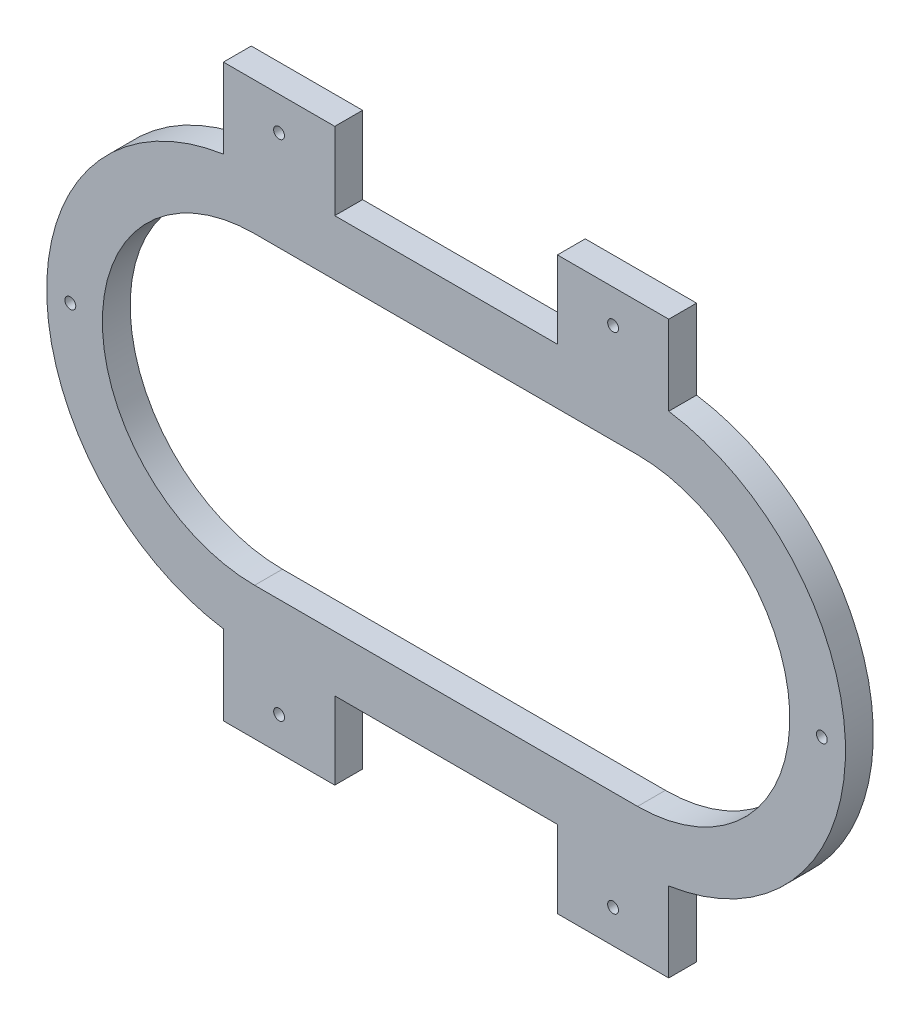
ISO-10303-21;
HEADER;
FILE_DESCRIPTION(('STEP AP214'),'2;1');
FILE_NAME('part.step','',(''),(''),'','','');
FILE_SCHEMA(('AUTOMOTIVE_DESIGN { 1 0 10303 214 1 1 1 1 }'));
ENDSEC;
DATA;
#1=APPLICATION_CONTEXT('core data for automotive mechanical design processes');
#2=APPLICATION_PROTOCOL_DEFINITION('international standard','automotive_design',2000,#1);
#3=PRODUCT_CONTEXT('',#1,'mechanical');
#4=PRODUCT('Part','Part','',(#3));
#5=PRODUCT_RELATED_PRODUCT_CATEGORY('part','',(#4));
#6=PRODUCT_DEFINITION_FORMATION('','',#4);
#7=PRODUCT_DEFINITION_CONTEXT('part definition',#1,'design');
#8=PRODUCT_DEFINITION('design','',#6,#7);
#9=PRODUCT_DEFINITION_SHAPE('','',#8);
#10=(LENGTH_UNIT() NAMED_UNIT(*) SI_UNIT(.MILLI.,.METRE.));
#11=(NAMED_UNIT(*) PLANE_ANGLE_UNIT() SI_UNIT($,.RADIAN.));
#12=(NAMED_UNIT(*) SI_UNIT($,.STERADIAN.) SOLID_ANGLE_UNIT());
#13=UNCERTAINTY_MEASURE_WITH_UNIT(LENGTH_MEASURE(1.E-05),#10,'distance_accuracy_value','');
#14=(GEOMETRIC_REPRESENTATION_CONTEXT(3) GLOBAL_UNCERTAINTY_ASSIGNED_CONTEXT((#13)) GLOBAL_UNIT_ASSIGNED_CONTEXT((#10,
#11,#12)) REPRESENTATION_CONTEXT('',''));
#15=CARTESIAN_POINT('',(0.,0.,0.));
#16=DIRECTION('',(0.,0.,1.));
#17=DIRECTION('',(1.,0.,0.));
#18=AXIS2_PLACEMENT_3D('',#15,#16,#17);
#19=CARTESIAN_POINT('',(67.4451075179196,6.36799466577763,10.));
#20=DIRECTION('',(0.,0.,-1.));
#21=DIRECTION('',(-1.,0.,0.));
#22=AXIS2_PLACEMENT_3D('',#19,#20,#21);
#23=CYLINDRICAL_SURFACE('',#22,54.7);
#24=CARTESIAN_POINT('',(67.4451075179196,6.36799466577763,0.));
#25=DIRECTION('',(0.,0.,1.));
#26=DIRECTION('',(1.,0.,0.));
#27=AXIS2_PLACEMENT_3D('',#24,#25,#26);
#28=CIRCLE('',#27,54.7);
#29=CARTESIAN_POINT('',(67.4451075179196,-48.3320053342224,0.));
#30=VERTEX_POINT('',#29);
#31=CARTESIAN_POINT('',(67.4451075179196,61.0679946657776,0.));
#32=VERTEX_POINT('',#31);
#33=EDGE_CURVE('E264',#30,#32,#28,.T.);
#34=ORIENTED_EDGE('',*,*,#33,.F.);
#35=DIRECTION('',(0.,0.,-1.));
#36=VECTOR('',#35,1.);
#37=CARTESIAN_POINT('',(67.4451075179196,-48.3320053342224,10.));
#38=LINE('',#37,#36);
#39=CARTESIAN_POINT('',(67.4451075179196,-48.3320053342224,10.));
#40=VERTEX_POINT('',#39);
#41=EDGE_CURVE('E11',#40,#30,#38,.T.);
#42=ORIENTED_EDGE('',*,*,#41,.F.);
#43=CARTESIAN_POINT('',(67.4451075179196,6.36799466577763,10.));
#44=DIRECTION('',(0.,0.,1.));
#45=DIRECTION('',(1.,0.,0.));
#46=AXIS2_PLACEMENT_3D('',#43,#44,#45);
#47=CIRCLE('',#46,54.7);
#48=CARTESIAN_POINT('',(67.4451075179196,61.0679946657776,10.));
#49=VERTEX_POINT('',#48);
#50=EDGE_CURVE('E198',#40,#49,#47,.T.);
#51=ORIENTED_EDGE('',*,*,#50,.T.);
#52=DIRECTION('',(0.,0.,-1.));
#53=VECTOR('',#52,1.);
#54=CARTESIAN_POINT('',(67.4451075179196,61.0679946657776,10.));
#55=LINE('',#54,#53);
#56=EDGE_CURVE('E126',#49,#32,#55,.T.);
#57=ORIENTED_EDGE('',*,*,#56,.T.);
#58=EDGE_LOOP('',(#34,#42,#51,#57));
#59=FACE_BOUND('',#58,.T.);
#60=ADVANCED_FACE('F37',(#59),#23,.F.);
#61=CARTESIAN_POINT('',(0.,-48.3320053342224,10.));
#62=DIRECTION('',(0.,1.,0.));
#63=DIRECTION('',(0.,0.,1.));
#64=AXIS2_PLACEMENT_3D('',#61,#62,#63);
#65=PLANE('',#64);
#66=DIRECTION('',(1.,0.,0.));
#67=VECTOR('',#66,1.);
#68=CARTESIAN_POINT('',(0.,-48.3320053342224,0.));
#69=LINE('',#68,#67);
#70=CARTESIAN_POINT('',(-70.1548924820804,-48.3320053342224,0.));
#71=VERTEX_POINT('',#70);
#72=EDGE_CURVE('E189',#71,#30,#69,.T.);
#73=ORIENTED_EDGE('',*,*,#72,.F.);
#74=DIRECTION('',(0.,0.,-1.));
#75=VECTOR('',#74,1.);
#76=CARTESIAN_POINT('',(-70.1548924820804,-48.3320053342224,10.));
#77=LINE('',#76,#75);
#78=CARTESIAN_POINT('',(-70.1548924820804,-48.3320053342224,10.));
#79=VERTEX_POINT('',#78);
#80=EDGE_CURVE('E47',#79,#71,#77,.T.);
#81=ORIENTED_EDGE('',*,*,#80,.F.);
#82=DIRECTION('',(1.,0.,0.));
#83=VECTOR('',#82,1.);
#84=CARTESIAN_POINT('',(0.,-48.3320053342224,10.));
#85=LINE('',#84,#83);
#86=EDGE_CURVE('E187',#79,#40,#85,.T.);
#87=ORIENTED_EDGE('',*,*,#86,.T.);
#88=ORIENTED_EDGE('',*,*,#41,.T.);
#89=EDGE_LOOP('',(#73,#81,#87,#88));
#90=FACE_BOUND('',#89,.T.);
#91=ADVANCED_FACE('F186',(#90),#65,.T.);
#92=CARTESIAN_POINT('',(-70.1548924820804,6.36799466577763,10.));
#93=DIRECTION('',(0.,0.,-1.));
#94=DIRECTION('',(-1.,0.,0.));
#95=AXIS2_PLACEMENT_3D('',#92,#93,#94);
#96=CYLINDRICAL_SURFACE('',#95,54.7);
#97=CARTESIAN_POINT('',(-70.1548924820804,6.36799466577763,0.));
#98=DIRECTION('',(0.,0.,1.));
#99=DIRECTION('',(1.,0.,0.));
#100=AXIS2_PLACEMENT_3D('',#97,#98,#99);
#101=CIRCLE('',#100,54.7);
#102=CARTESIAN_POINT('',(-70.1548924820804,61.0679946657776,0.));
#103=VERTEX_POINT('',#102);
#104=EDGE_CURVE('E268',#103,#71,#101,.T.);
#105=ORIENTED_EDGE('',*,*,#104,.F.);
#106=DIRECTION('',(0.,0.,-1.));
#107=VECTOR('',#106,1.);
#108=CARTESIAN_POINT('',(-70.1548924820804,61.0679946657776,10.));
#109=LINE('',#108,#107);
#110=CARTESIAN_POINT('',(-70.1548924820804,61.0679946657776,10.));
#111=VERTEX_POINT('',#110);
#112=EDGE_CURVE('E119',#111,#103,#109,.T.);
#113=ORIENTED_EDGE('',*,*,#112,.F.);
#114=CARTESIAN_POINT('',(-70.1548924820804,6.36799466577763,10.));
#115=DIRECTION('',(0.,0.,1.));
#116=DIRECTION('',(1.,0.,0.));
#117=AXIS2_PLACEMENT_3D('',#114,#115,#116);
#118=CIRCLE('',#117,54.7);
#119=EDGE_CURVE('E197',#111,#79,#118,.T.);
#120=ORIENTED_EDGE('',*,*,#119,.T.);
#121=ORIENTED_EDGE('',*,*,#80,.T.);
#122=EDGE_LOOP('',(#105,#113,#120,#121));
#123=FACE_BOUND('',#122,.T.);
#124=ADVANCED_FACE('F200',(#123),#96,.F.);
#125=CARTESIAN_POINT('',(0.,81.0679946657776,10.));
#126=DIRECTION('',(0.,1.,0.));
#127=DIRECTION('',(0.,0.,1.));
#128=AXIS2_PLACEMENT_3D('',#125,#126,#127);
#129=PLANE('',#128);
#130=DIRECTION('',(1.,0.,0.));
#131=VECTOR('',#130,1.);
#132=CARTESIAN_POINT('',(0.,81.0679946657776,0.));
#133=LINE('',#132,#131);
#134=CARTESIAN_POINT('',(-41.3548924820804,81.0679946657776,0.));
#135=VERTEX_POINT('',#134);
#136=CARTESIAN_POINT('',(38.6451075179196,81.0679946657776,0.));
#137=VERTEX_POINT('',#136);
#138=EDGE_CURVE('E218',#135,#137,#133,.T.);
#139=ORIENTED_EDGE('',*,*,#138,.F.);
#140=DIRECTION('',(0.,0.,-1.));
#141=VECTOR('',#140,1.);
#142=CARTESIAN_POINT('',(-41.3548924820804,81.0679946657776,10.));
#143=LINE('',#142,#141);
#144=CARTESIAN_POINT('',(-41.3548924820804,81.0679946657776,10.));
#145=VERTEX_POINT('',#144);
#146=EDGE_CURVE('E41',#145,#135,#143,.T.);
#147=ORIENTED_EDGE('',*,*,#146,.F.);
#148=DIRECTION('',(1.,0.,0.));
#149=VECTOR('',#148,1.);
#150=CARTESIAN_POINT('',(0.,81.0679946657776,10.));
#151=LINE('',#150,#149);
#152=CARTESIAN_POINT('',(38.6451075179196,81.0679946657776,10.));
#153=VERTEX_POINT('',#152);
#154=EDGE_CURVE('E284',#145,#153,#151,.T.);
#155=ORIENTED_EDGE('',*,*,#154,.T.);
#156=DIRECTION('',(0.,0.,-1.));
#157=VECTOR('',#156,1.);
#158=CARTESIAN_POINT('',(38.6451075179196,81.0679946657776,10.));
#159=LINE('',#158,#157);
#160=EDGE_CURVE('E217',#153,#137,#159,.T.);
#161=ORIENTED_EDGE('',*,*,#160,.T.);
#162=EDGE_LOOP('',(#139,#147,#155,#161));
#163=FACE_BOUND('',#162,.T.);
#164=ADVANCED_FACE('F39',(#163),#129,.T.);
#165=CARTESIAN_POINT('',(-41.3548924820804,0.,10.));
#166=DIRECTION('',(-1.,0.,0.));
#167=DIRECTION('',(0.,0.,1.));
#168=AXIS2_PLACEMENT_3D('',#165,#166,#167);
#169=PLANE('',#168);
#170=DIRECTION('',(0.,1.,0.));
#171=VECTOR('',#170,1.);
#172=CARTESIAN_POINT('',(-41.3548924820804,0.,0.));
#173=LINE('',#172,#171);
#174=CARTESIAN_POINT('',(-41.3548924820804,108.867994665778,0.));
#175=VERTEX_POINT('',#174);
#176=EDGE_CURVE('E221',#135,#175,#173,.T.);
#177=ORIENTED_EDGE('',*,*,#176,.T.);
#178=DIRECTION('',(0.,0.,-1.));
#179=VECTOR('',#178,1.);
#180=CARTESIAN_POINT('',(-41.3548924820804,108.867994665778,10.));
#181=LINE('',#180,#179);
#182=CARTESIAN_POINT('',(-41.3548924820804,108.867994665778,10.));
#183=VERTEX_POINT('',#182);
#184=EDGE_CURVE('E320',#183,#175,#181,.T.);
#185=ORIENTED_EDGE('',*,*,#184,.F.);
#186=DIRECTION('',(0.,1.,0.));
#187=VECTOR('',#186,1.);
#188=CARTESIAN_POINT('',(-41.3548924820804,0.,10.));
#189=LINE('',#188,#187);
#190=EDGE_CURVE('E329',#145,#183,#189,.T.);
#191=ORIENTED_EDGE('',*,*,#190,.F.);
#192=ORIENTED_EDGE('',*,*,#146,.T.);
#193=EDGE_LOOP('',(#177,#185,#191,#192));
#194=FACE_BOUND('',#193,.T.);
#195=ADVANCED_FACE('F328',(#194),#169,.F.);
#196=CARTESIAN_POINT('',(0.,108.867994665778,10.));
#197=DIRECTION('',(0.,-1.,0.));
#198=DIRECTION('',(0.,0.,-1.));
#199=AXIS2_PLACEMENT_3D('',#196,#197,#198);
#200=PLANE('',#199);
#201=DIRECTION('',(-1.,0.,0.));
#202=VECTOR('',#201,1.);
#203=CARTESIAN_POINT('',(0.,108.867994665778,0.));
#204=LINE('',#203,#202);
#205=CARTESIAN_POINT('',(-81.3548924820804,108.867994665778,0.));
#206=VERTEX_POINT('',#205);
#207=EDGE_CURVE('E223',#175,#206,#204,.T.);
#208=ORIENTED_EDGE('',*,*,#207,.T.);
#209=DIRECTION('',(0.,0.,-1.));
#210=VECTOR('',#209,1.);
#211=CARTESIAN_POINT('',(-81.3548924820804,108.867994665778,10.));
#212=LINE('',#211,#210);
#213=CARTESIAN_POINT('',(-81.3548924820804,108.867994665778,10.));
#214=VERTEX_POINT('',#213);
#215=EDGE_CURVE('E318',#214,#206,#212,.T.);
#216=ORIENTED_EDGE('',*,*,#215,.F.);
#217=DIRECTION('',(-1.,0.,0.));
#218=VECTOR('',#217,1.);
#219=CARTESIAN_POINT('',(0.,108.867994665778,10.));
#220=LINE('',#219,#218);
#221=EDGE_CURVE('E410',#183,#214,#220,.T.);
#222=ORIENTED_EDGE('',*,*,#221,.F.);
#223=ORIENTED_EDGE('',*,*,#184,.T.);
#224=EDGE_LOOP('',(#208,#216,#222,#223));
#225=FACE_BOUND('',#224,.T.);
#226=ADVANCED_FACE('F409',(#225),#200,.F.);
#227=CARTESIAN_POINT('',(-81.3548924820804,0.,10.));
#228=DIRECTION('',(1.,0.,0.));
#229=DIRECTION('',(0.,0.,-1.));
#230=AXIS2_PLACEMENT_3D('',#227,#228,#229);
#231=PLANE('',#230);
#232=DIRECTION('',(0.,-1.,0.));
#233=VECTOR('',#232,1.);
#234=CARTESIAN_POINT('',(-81.3548924820804,0.,0.));
#235=LINE('',#234,#233);
#236=CARTESIAN_POINT('',(-81.3548924820804,80.223597026059,0.));
#237=VERTEX_POINT('',#236);
#238=EDGE_CURVE('E225',#206,#237,#235,.T.);
#239=ORIENTED_EDGE('',*,*,#238,.T.);
#240=DIRECTION('',(0.,0.,-1.));
#241=VECTOR('',#240,1.);
#242=CARTESIAN_POINT('',(-81.3548924820804,80.223597026059,10.));
#243=LINE('',#242,#241);
#244=CARTESIAN_POINT('',(-81.3548924820804,80.223597026059,10.));
#245=VERTEX_POINT('',#244);
#246=EDGE_CURVE('E315',#245,#237,#243,.T.);
#247=ORIENTED_EDGE('',*,*,#246,.F.);
#248=DIRECTION('',(0.,-1.,0.));
#249=VECTOR('',#248,1.);
#250=CARTESIAN_POINT('',(-81.3548924820804,0.,10.));
#251=LINE('',#250,#249);
#252=EDGE_CURVE('E407',#214,#245,#251,.T.);
#253=ORIENTED_EDGE('',*,*,#252,.F.);
#254=ORIENTED_EDGE('',*,*,#215,.T.);
#255=EDGE_LOOP('',(#239,#247,#253,#254));
#256=FACE_BOUND('',#255,.T.);
#257=ADVANCED_FACE('F406',(#256),#231,.F.);
#258=CARTESIAN_POINT('',(-70.1548924820804,6.36799466577763,10.));
#259=DIRECTION('',(0.,0.,-1.));
#260=DIRECTION('',(-1.,0.,0.));
#261=AXIS2_PLACEMENT_3D('',#258,#259,#260);
#262=CYLINDRICAL_SURFACE('',#261,74.7);
#263=CARTESIAN_POINT('',(-70.1548924820804,6.36799466577763,0.));
#264=DIRECTION('',(0.,0.,1.));
#265=DIRECTION('',(1.,0.,0.));
#266=AXIS2_PLACEMENT_3D('',#263,#264,#265);
#267=CIRCLE('',#266,74.7);
#268=CARTESIAN_POINT('',(-81.3548924820804,-67.4876076945038,0.));
#269=VERTEX_POINT('',#268);
#270=EDGE_CURVE('E227',#237,#269,#267,.T.);
#271=ORIENTED_EDGE('',*,*,#270,.T.);
#272=DIRECTION('',(0.,0.,-1.));
#273=VECTOR('',#272,1.);
#274=CARTESIAN_POINT('',(-81.3548924820804,-67.4876076945038,10.));
#275=LINE('',#274,#273);
#276=CARTESIAN_POINT('',(-81.3548924820804,-67.4876076945038,10.));
#277=VERTEX_POINT('',#276);
#278=EDGE_CURVE('E312',#277,#269,#275,.T.);
#279=ORIENTED_EDGE('',*,*,#278,.F.);
#280=CARTESIAN_POINT('',(-70.1548924820804,6.36799466577763,10.));
#281=DIRECTION('',(0.,0.,1.));
#282=DIRECTION('',(1.,0.,0.));
#283=AXIS2_PLACEMENT_3D('',#280,#281,#282);
#284=CIRCLE('',#283,74.7);
#285=EDGE_CURVE('E402',#245,#277,#284,.T.);
#286=ORIENTED_EDGE('',*,*,#285,.F.);
#287=ORIENTED_EDGE('',*,*,#246,.T.);
#288=EDGE_LOOP('',(#271,#279,#286,#287));
#289=FACE_BOUND('',#288,.T.);
#290=ADVANCED_FACE('F401',(#289),#262,.T.);
#291=CARTESIAN_POINT('',(-81.3548924820804,0.,10.));
#292=DIRECTION('',(1.,0.,0.));
#293=DIRECTION('',(0.,0.,-1.));
#294=AXIS2_PLACEMENT_3D('',#291,#292,#293);
#295=PLANE('',#294);
#296=DIRECTION('',(0.,-1.,0.));
#297=VECTOR('',#296,1.);
#298=CARTESIAN_POINT('',(-81.3548924820804,0.,0.));
#299=LINE('',#298,#297);
#300=CARTESIAN_POINT('',(-81.3548924820804,-96.1320053342224,0.));
#301=VERTEX_POINT('',#300);
#302=EDGE_CURVE('E229',#269,#301,#299,.T.);
#303=ORIENTED_EDGE('',*,*,#302,.T.);
#304=DIRECTION('',(0.,0.,-1.));
#305=VECTOR('',#304,1.);
#306=CARTESIAN_POINT('',(-81.3548924820804,-96.1320053342224,10.));
#307=LINE('',#306,#305);
#308=CARTESIAN_POINT('',(-81.3548924820804,-96.1320053342224,10.));
#309=VERTEX_POINT('',#308);
#310=EDGE_CURVE('E310',#309,#301,#307,.T.);
#311=ORIENTED_EDGE('',*,*,#310,.F.);
#312=DIRECTION('',(0.,-1.,0.));
#313=VECTOR('',#312,1.);
#314=CARTESIAN_POINT('',(-81.3548924820804,0.,10.));
#315=LINE('',#314,#313);
#316=EDGE_CURVE('E398',#277,#309,#315,.T.);
#317=ORIENTED_EDGE('',*,*,#316,.F.);
#318=ORIENTED_EDGE('',*,*,#278,.T.);
#319=EDGE_LOOP('',(#303,#311,#317,#318));
#320=FACE_BOUND('',#319,.T.);
#321=ADVANCED_FACE('F395',(#320),#295,.F.);
#322=CARTESIAN_POINT('',(0.,-96.1320053342224,10.));
#323=DIRECTION('',(0.,-1.,0.));
#324=DIRECTION('',(0.,0.,-1.));
#325=AXIS2_PLACEMENT_3D('',#322,#323,#324);
#326=PLANE('',#325);
#327=DIRECTION('',(-1.,0.,0.));
#328=VECTOR('',#327,1.);
#329=CARTESIAN_POINT('',(0.,-96.1320053342224,0.));
#330=LINE('',#329,#328);
#331=CARTESIAN_POINT('',(-41.3548924820804,-96.1320053342224,0.));
#332=VERTEX_POINT('',#331);
#333=EDGE_CURVE('E232',#332,#301,#330,.T.);
#334=ORIENTED_EDGE('',*,*,#333,.F.);
#335=DIRECTION('',(0.,0.,-1.));
#336=VECTOR('',#335,1.);
#337=CARTESIAN_POINT('',(-41.3548924820804,-96.1320053342224,10.));
#338=LINE('',#337,#336);
#339=CARTESIAN_POINT('',(-41.3548924820804,-96.1320053342224,10.));
#340=VERTEX_POINT('',#339);
#341=EDGE_CURVE('E308',#340,#332,#338,.T.);
#342=ORIENTED_EDGE('',*,*,#341,.F.);
#343=DIRECTION('',(-1.,0.,0.));
#344=VECTOR('',#343,1.);
#345=CARTESIAN_POINT('',(0.,-96.1320053342224,10.));
#346=LINE('',#345,#344);
#347=EDGE_CURVE('E419',#340,#309,#346,.T.);
#348=ORIENTED_EDGE('',*,*,#347,.T.);
#349=ORIENTED_EDGE('',*,*,#310,.T.);
#350=EDGE_LOOP('',(#334,#342,#348,#349));
#351=FACE_BOUND('',#350,.T.);
#352=ADVANCED_FACE('F390',(#351),#326,.T.);
#353=CARTESIAN_POINT('',(-41.3548924820804,0.,10.));
#354=DIRECTION('',(1.,0.,0.));
#355=DIRECTION('',(0.,1.,0.));
#356=AXIS2_PLACEMENT_3D('',#353,#354,#355);
#357=PLANE('',#356);
#358=DIRECTION('',(0.,-1.,0.));
#359=VECTOR('',#358,1.);
#360=CARTESIAN_POINT('',(-41.3548924820804,0.,0.));
#361=LINE('',#360,#359);
#362=CARTESIAN_POINT('',(-41.3548924820804,-68.3320053342224,0.));
#363=VERTEX_POINT('',#362);
#364=EDGE_CURVE('E235',#363,#332,#361,.T.);
#365=ORIENTED_EDGE('',*,*,#364,.F.);
#366=DIRECTION('',(0.,0.,-1.));
#367=VECTOR('',#366,1.);
#368=CARTESIAN_POINT('',(-41.3548924820804,-68.3320053342224,10.));
#369=LINE('',#368,#367);
#370=CARTESIAN_POINT('',(-41.3548924820804,-68.3320053342224,10.));
#371=VERTEX_POINT('',#370);
#372=EDGE_CURVE('E306',#371,#363,#369,.T.);
#373=ORIENTED_EDGE('',*,*,#372,.F.);
#374=DIRECTION('',(0.,-1.,0.));
#375=VECTOR('',#374,1.);
#376=CARTESIAN_POINT('',(-41.3548924820804,0.,10.));
#377=LINE('',#376,#375);
#378=EDGE_CURVE('E386',#371,#340,#377,.T.);
#379=ORIENTED_EDGE('',*,*,#378,.T.);
#380=ORIENTED_EDGE('',*,*,#341,.T.);
#381=EDGE_LOOP('',(#365,#373,#379,#380));
#382=FACE_BOUND('',#381,.T.);
#383=ADVANCED_FACE('F381',(#382),#357,.T.);
#384=CARTESIAN_POINT('',(0.,-68.3320053342224,10.));
#385=DIRECTION('',(0.,1.,0.));
#386=DIRECTION('',(0.,0.,1.));
#387=AXIS2_PLACEMENT_3D('',#384,#385,#386);
#388=PLANE('',#387);
#389=DIRECTION('',(1.,0.,0.));
#390=VECTOR('',#389,1.);
#391=CARTESIAN_POINT('',(0.,-68.3320053342224,0.));
#392=LINE('',#391,#390);
#393=CARTESIAN_POINT('',(38.6451075179196,-68.3320053342224,0.));
#394=VERTEX_POINT('',#393);
#395=EDGE_CURVE('E238',#363,#394,#392,.T.);
#396=ORIENTED_EDGE('',*,*,#395,.T.);
#397=DIRECTION('',(0.,0.,-1.));
#398=VECTOR('',#397,1.);
#399=CARTESIAN_POINT('',(38.6451075179196,-68.3320053342224,10.));
#400=LINE('',#399,#398);
#401=CARTESIAN_POINT('',(38.6451075179196,-68.3320053342224,10.));
#402=VERTEX_POINT('',#401);
#403=EDGE_CURVE('E303',#402,#394,#400,.T.);
#404=ORIENTED_EDGE('',*,*,#403,.F.);
#405=DIRECTION('',(1.,0.,0.));
#406=VECTOR('',#405,1.);
#407=CARTESIAN_POINT('',(0.,-68.3320053342224,10.));
#408=LINE('',#407,#406);
#409=EDGE_CURVE('E422',#371,#402,#408,.T.);
#410=ORIENTED_EDGE('',*,*,#409,.F.);
#411=ORIENTED_EDGE('',*,*,#372,.T.);
#412=EDGE_LOOP('',(#396,#404,#410,#411));
#413=FACE_BOUND('',#412,.T.);
#414=ADVANCED_FACE('F481',(#413),#388,.F.);
#415=CARTESIAN_POINT('',(38.6451075179196,0.,10.));
#416=DIRECTION('',(1.,0.,0.));
#417=DIRECTION('',(0.,0.,-1.));
#418=AXIS2_PLACEMENT_3D('',#415,#416,#417);
#419=PLANE('',#418);
#420=DIRECTION('',(0.,-1.,0.));
#421=VECTOR('',#420,1.);
#422=CARTESIAN_POINT('',(38.6451075179196,0.,0.));
#423=LINE('',#422,#421);
#424=CARTESIAN_POINT('',(38.6451075179196,-96.1320053342224,0.));
#425=VERTEX_POINT('',#424);
#426=EDGE_CURVE('E240',#394,#425,#423,.T.);
#427=ORIENTED_EDGE('',*,*,#426,.T.);
#428=DIRECTION('',(0.,0.,-1.));
#429=VECTOR('',#428,1.);
#430=CARTESIAN_POINT('',(38.6451075179196,-96.1320053342224,10.));
#431=LINE('',#430,#429);
#432=CARTESIAN_POINT('',(38.6451075179196,-96.1320053342224,10.));
#433=VERTEX_POINT('',#432);
#434=EDGE_CURVE('E300',#433,#425,#431,.T.);
#435=ORIENTED_EDGE('',*,*,#434,.F.);
#436=DIRECTION('',(0.,-1.,0.));
#437=VECTOR('',#436,1.);
#438=CARTESIAN_POINT('',(38.6451075179196,0.,10.));
#439=LINE('',#438,#437);
#440=EDGE_CURVE('E375',#402,#433,#439,.T.);
#441=ORIENTED_EDGE('',*,*,#440,.F.);
#442=ORIENTED_EDGE('',*,*,#403,.T.);
#443=EDGE_LOOP('',(#427,#435,#441,#442));
#444=FACE_BOUND('',#443,.T.);
#445=ADVANCED_FACE('F374',(#444),#419,.F.);
#446=CARTESIAN_POINT('',(0.,-96.1320053342224,10.));
#447=DIRECTION('',(0.,1.,0.));
#448=DIRECTION('',(0.,0.,1.));
#449=AXIS2_PLACEMENT_3D('',#446,#447,#448);
#450=PLANE('',#449);
#451=DIRECTION('',(1.,0.,0.));
#452=VECTOR('',#451,1.);
#453=CARTESIAN_POINT('',(0.,-96.1320053342224,0.));
#454=LINE('',#453,#452);
#455=CARTESIAN_POINT('',(78.6451075179196,-96.1320053342224,0.));
#456=VERTEX_POINT('',#455);
#457=EDGE_CURVE('E242',#425,#456,#454,.T.);
#458=ORIENTED_EDGE('',*,*,#457,.T.);
#459=DIRECTION('',(0.,0.,-1.));
#460=VECTOR('',#459,1.);
#461=CARTESIAN_POINT('',(78.6451075179196,-96.1320053342224,10.));
#462=LINE('',#461,#460);
#463=CARTESIAN_POINT('',(78.6451075179196,-96.1320053342224,10.));
#464=VERTEX_POINT('',#463);
#465=EDGE_CURVE('E297',#464,#456,#462,.T.);
#466=ORIENTED_EDGE('',*,*,#465,.F.);
#467=DIRECTION('',(1.,0.,0.));
#468=VECTOR('',#467,1.);
#469=CARTESIAN_POINT('',(0.,-96.1320053342224,10.));
#470=LINE('',#469,#468);
#471=EDGE_CURVE('E370',#433,#464,#470,.T.);
#472=ORIENTED_EDGE('',*,*,#471,.F.);
#473=ORIENTED_EDGE('',*,*,#434,.T.);
#474=EDGE_LOOP('',(#458,#466,#472,#473));
#475=FACE_BOUND('',#474,.T.);
#476=ADVANCED_FACE('F369',(#475),#450,.F.);
#477=CARTESIAN_POINT('',(78.6451075179196,0.,10.));
#478=DIRECTION('',(-1.,0.,0.));
#479=DIRECTION('',(0.,0.,1.));
#480=AXIS2_PLACEMENT_3D('',#477,#478,#479);
#481=PLANE('',#480);
#482=DIRECTION('',(0.,1.,0.));
#483=VECTOR('',#482,1.);
#484=CARTESIAN_POINT('',(78.6451075179196,0.,0.));
#485=LINE('',#484,#483);
#486=CARTESIAN_POINT('',(78.6451075179196,-67.4876076945038,0.));
#487=VERTEX_POINT('',#486);
#488=EDGE_CURVE('E244',#456,#487,#485,.T.);
#489=ORIENTED_EDGE('',*,*,#488,.T.);
#490=DIRECTION('',(0.,0.,-1.));
#491=VECTOR('',#490,1.);
#492=CARTESIAN_POINT('',(78.6451075179196,-67.4876076945038,10.));
#493=LINE('',#492,#491);
#494=CARTESIAN_POINT('',(78.6451075179196,-67.4876076945038,10.));
#495=VERTEX_POINT('',#494);
#496=EDGE_CURVE('E294',#495,#487,#493,.T.);
#497=ORIENTED_EDGE('',*,*,#496,.F.);
#498=DIRECTION('',(0.,1.,0.));
#499=VECTOR('',#498,1.);
#500=CARTESIAN_POINT('',(78.6451075179196,0.,10.));
#501=LINE('',#500,#499);
#502=EDGE_CURVE('E366',#464,#495,#501,.T.);
#503=ORIENTED_EDGE('',*,*,#502,.F.);
#504=ORIENTED_EDGE('',*,*,#465,.T.);
#505=EDGE_LOOP('',(#489,#497,#503,#504));
#506=FACE_BOUND('',#505,.T.);
#507=ADVANCED_FACE('F363',(#506),#481,.F.);
#508=CARTESIAN_POINT('',(67.4451075179196,6.36799466577763,10.));
#509=DIRECTION('',(0.,0.,-1.));
#510=DIRECTION('',(-1.,0.,0.));
#511=AXIS2_PLACEMENT_3D('',#508,#509,#510);
#512=CYLINDRICAL_SURFACE('',#511,74.7);
#513=CARTESIAN_POINT('',(67.4451075179196,6.36799466577763,0.));
#514=DIRECTION('',(0.,0.,1.));
#515=DIRECTION('',(1.,0.,0.));
#516=AXIS2_PLACEMENT_3D('',#513,#514,#515);
#517=CIRCLE('',#516,74.7);
#518=CARTESIAN_POINT('',(78.6451075179196,80.223597026059,0.));
#519=VERTEX_POINT('',#518);
#520=EDGE_CURVE('E246',#487,#519,#517,.T.);
#521=ORIENTED_EDGE('',*,*,#520,.T.);
#522=DIRECTION('',(0.,0.,-1.));
#523=VECTOR('',#522,1.);
#524=CARTESIAN_POINT('',(78.6451075179196,80.223597026059,10.));
#525=LINE('',#524,#523);
#526=CARTESIAN_POINT('',(78.6451075179196,80.223597026059,10.));
#527=VERTEX_POINT('',#526);
#528=EDGE_CURVE('E292',#527,#519,#525,.T.);
#529=ORIENTED_EDGE('',*,*,#528,.F.);
#530=CARTESIAN_POINT('',(67.4451075179196,6.36799466577763,10.));
#531=DIRECTION('',(0.,0.,1.));
#532=DIRECTION('',(1.,0.,0.));
#533=AXIS2_PLACEMENT_3D('',#530,#531,#532);
#534=CIRCLE('',#533,74.7);
#535=EDGE_CURVE('E427',#495,#527,#534,.T.);
#536=ORIENTED_EDGE('',*,*,#535,.F.);
#537=ORIENTED_EDGE('',*,*,#496,.T.);
#538=EDGE_LOOP('',(#521,#529,#536,#537));
#539=FACE_BOUND('',#538,.T.);
#540=ADVANCED_FACE('F357',(#539),#512,.T.);
#541=CARTESIAN_POINT('',(78.6451075179196,0.,10.));
#542=DIRECTION('',(1.,0.,0.));
#543=DIRECTION('',(0.,0.,-1.));
#544=AXIS2_PLACEMENT_3D('',#541,#542,#543);
#545=PLANE('',#544);
#546=DIRECTION('',(0.,-1.,0.));
#547=VECTOR('',#546,1.);
#548=CARTESIAN_POINT('',(78.6451075179196,0.,0.));
#549=LINE('',#548,#547);
#550=CARTESIAN_POINT('',(78.6451075179196,108.867994665778,0.));
#551=VERTEX_POINT('',#550);
#552=EDGE_CURVE('E249',#551,#519,#549,.T.);
#553=ORIENTED_EDGE('',*,*,#552,.F.);
#554=DIRECTION('',(0.,0.,-1.));
#555=VECTOR('',#554,1.);
#556=CARTESIAN_POINT('',(78.6451075179196,108.867994665778,10.));
#557=LINE('',#556,#555);
#558=CARTESIAN_POINT('',(78.6451075179196,108.867994665778,10.));
#559=VERTEX_POINT('',#558);
#560=EDGE_CURVE('E290',#559,#551,#557,.T.);
#561=ORIENTED_EDGE('',*,*,#560,.F.);
#562=DIRECTION('',(0.,-1.,0.));
#563=VECTOR('',#562,1.);
#564=CARTESIAN_POINT('',(78.6451075179196,0.,10.));
#565=LINE('',#564,#563);
#566=EDGE_CURVE('E354',#559,#527,#565,.T.);
#567=ORIENTED_EDGE('',*,*,#566,.T.);
#568=ORIENTED_EDGE('',*,*,#528,.T.);
#569=EDGE_LOOP('',(#553,#561,#567,#568));
#570=FACE_BOUND('',#569,.T.);
#571=ADVANCED_FACE('F352',(#570),#545,.T.);
#572=CARTESIAN_POINT('',(0.,108.867994665778,10.));
#573=DIRECTION('',(0.,1.,0.));
#574=DIRECTION('',(0.,0.,1.));
#575=AXIS2_PLACEMENT_3D('',#572,#573,#574);
#576=PLANE('',#575);
#577=DIRECTION('',(1.,0.,0.));
#578=VECTOR('',#577,1.);
#579=CARTESIAN_POINT('',(0.,108.867994665778,0.));
#580=LINE('',#579,#578);
#581=CARTESIAN_POINT('',(38.6451075179196,108.867994665778,0.));
#582=VERTEX_POINT('',#581);
#583=EDGE_CURVE('E252',#582,#551,#580,.T.);
#584=ORIENTED_EDGE('',*,*,#583,.F.);
#585=DIRECTION('',(0.,0.,-1.));
#586=VECTOR('',#585,1.);
#587=CARTESIAN_POINT('',(38.6451075179196,108.867994665778,10.));
#588=LINE('',#587,#586);
#589=CARTESIAN_POINT('',(38.6451075179196,108.867994665778,10.));
#590=VERTEX_POINT('',#589);
#591=EDGE_CURVE('E288',#590,#582,#588,.T.);
#592=ORIENTED_EDGE('',*,*,#591,.F.);
#593=DIRECTION('',(1.,0.,0.));
#594=VECTOR('',#593,1.);
#595=CARTESIAN_POINT('',(0.,108.867994665778,10.));
#596=LINE('',#595,#594);
#597=EDGE_CURVE('E348',#590,#559,#596,.T.);
#598=ORIENTED_EDGE('',*,*,#597,.T.);
#599=ORIENTED_EDGE('',*,*,#560,.T.);
#600=EDGE_LOOP('',(#584,#592,#598,#599));
#601=FACE_BOUND('',#600,.T.);
#602=ADVANCED_FACE('F345',(#601),#576,.T.);
#603=CARTESIAN_POINT('',(58.6451075179196,-84.1320053342224,10.));
#604=DIRECTION('',(0.,0.,-1.));
#605=DIRECTION('',(-1.,0.,0.));
#606=AXIS2_PLACEMENT_3D('',#603,#604,#605);
#607=CYLINDRICAL_SURFACE('',#606,1.95);
#608=CARTESIAN_POINT('',(58.6451075179196,-84.1320053342224,10.));
#609=DIRECTION('',(0.,0.,1.));
#610=DIRECTION('',(1.,0.,0.));
#611=AXIS2_PLACEMENT_3D('',#608,#609,#610);
#612=CIRCLE('',#611,1.95);
#613=CARTESIAN_POINT('',(60.5951075179196,-84.1320053342224,10.));
#614=VERTEX_POINT('',#613);
#615=EDGE_CURVE('E211',#614,#614,#612,.T.);
#616=ORIENTED_EDGE('',*,*,#615,.T.);
#617=EDGE_LOOP('',(#616));
#618=FACE_BOUND('',#617,.T.);
#619=CARTESIAN_POINT('',(58.6451075179196,-84.1320053342224,0.));
#620=DIRECTION('',(0.,0.,1.));
#621=DIRECTION('',(1.,0.,0.));
#622=AXIS2_PLACEMENT_3D('',#619,#620,#621);
#623=CIRCLE('',#622,1.95);
#624=CARTESIAN_POINT('',(60.5951075179196,-84.1320053342224,0.));
#625=VERTEX_POINT('',#624);
#626=EDGE_CURVE('E278',#625,#625,#623,.T.);
#627=ORIENTED_EDGE('',*,*,#626,.F.);
#628=EDGE_LOOP('',(#627));
#629=FACE_BOUND('',#628,.T.);
#630=ADVANCED_FACE('F470',(#618,#629),#607,.F.);
#631=CARTESIAN_POINT('',(58.6451075179196,96.8679946657776,10.));
#632=DIRECTION('',(0.,0.,-1.));
#633=DIRECTION('',(-1.,0.,0.));
#634=AXIS2_PLACEMENT_3D('',#631,#632,#633);
#635=CYLINDRICAL_SURFACE('',#634,1.95);
#636=CARTESIAN_POINT('',(58.6451075179196,96.8679946657776,10.));
#637=DIRECTION('',(0.,0.,1.));
#638=DIRECTION('',(1.,0.,0.));
#639=AXIS2_PLACEMENT_3D('',#636,#637,#638);
#640=CIRCLE('',#639,1.95);
#641=CARTESIAN_POINT('',(60.5951075179196,96.8679946657776,10.));
#642=VERTEX_POINT('',#641);
#643=EDGE_CURVE('E208',#642,#642,#640,.T.);
#644=ORIENTED_EDGE('',*,*,#643,.T.);
#645=EDGE_LOOP('',(#644));
#646=FACE_BOUND('',#645,.T.);
#647=CARTESIAN_POINT('',(58.6451075179196,96.8679946657776,0.));
#648=DIRECTION('',(0.,0.,1.));
#649=DIRECTION('',(1.,0.,0.));
#650=AXIS2_PLACEMENT_3D('',#647,#648,#649);
#651=CIRCLE('',#650,1.95);
#652=CARTESIAN_POINT('',(60.5951075179196,96.8679946657776,0.));
#653=VERTEX_POINT('',#652);
#654=EDGE_CURVE('E275',#653,#653,#651,.T.);
#655=ORIENTED_EDGE('',*,*,#654,.F.);
#656=EDGE_LOOP('',(#655));
#657=FACE_BOUND('',#656,.T.);
#658=ADVANCED_FACE('F451',(#646,#657),#635,.F.);
#659=CARTESIAN_POINT('',(-61.3548924820804,96.8679946657776,10.));
#660=DIRECTION('',(0.,0.,-1.));
#661=DIRECTION('',(-1.,0.,0.));
#662=AXIS2_PLACEMENT_3D('',#659,#660,#661);
#663=CYLINDRICAL_SURFACE('',#662,1.95);
#664=CARTESIAN_POINT('',(-61.3548924820804,96.8679946657776,10.));
#665=DIRECTION('',(0.,0.,1.));
#666=DIRECTION('',(1.,0.,0.));
#667=AXIS2_PLACEMENT_3D('',#664,#665,#666);
#668=CIRCLE('',#667,1.95);
#669=CARTESIAN_POINT('',(-59.4048924820804,96.8679946657776,10.));
#670=VERTEX_POINT('',#669);
#671=EDGE_CURVE('E202',#670,#670,#668,.T.);
#672=ORIENTED_EDGE('',*,*,#671,.T.);
#673=EDGE_LOOP('',(#672));
#674=FACE_BOUND('',#673,.T.);
#675=CARTESIAN_POINT('',(-61.3548924820804,96.8679946657776,0.));
#676=DIRECTION('',(0.,0.,1.));
#677=DIRECTION('',(1.,0.,0.));
#678=AXIS2_PLACEMENT_3D('',#675,#676,#677);
#679=CIRCLE('',#678,1.95);
#680=CARTESIAN_POINT('',(-59.4048924820804,96.8679946657776,0.));
#681=VERTEX_POINT('',#680);
#682=EDGE_CURVE('E272',#681,#681,#679,.T.);
#683=ORIENTED_EDGE('',*,*,#682,.F.);
#684=EDGE_LOOP('',(#683));
#685=FACE_BOUND('',#684,.T.);
#686=ADVANCED_FACE('F442',(#674,#685),#663,.F.);
#687=CARTESIAN_POINT('',(0.,61.0679946657776,10.));
#688=DIRECTION('',(0.,1.,0.));
#689=DIRECTION('',(0.,0.,1.));
#690=AXIS2_PLACEMENT_3D('',#687,#688,#689);
#691=PLANE('',#690);
#692=DIRECTION('',(1.,0.,0.));
#693=VECTOR('',#692,1.);
#694=CARTESIAN_POINT('',(0.,61.0679946657776,0.));
#695=LINE('',#694,#693);
#696=EDGE_CURVE('E270',#103,#32,#695,.T.);
#697=ORIENTED_EDGE('',*,*,#696,.T.);
#698=ORIENTED_EDGE('',*,*,#56,.F.);
#699=DIRECTION('',(1.,0.,0.));
#700=VECTOR('',#699,1.);
#701=CARTESIAN_POINT('',(0.,61.0679946657776,10.));
#702=LINE('',#701,#700);
#703=EDGE_CURVE('E56',#111,#49,#702,.T.);
#704=ORIENTED_EDGE('',*,*,#703,.F.);
#705=ORIENTED_EDGE('',*,*,#112,.T.);
#706=EDGE_LOOP('',(#697,#698,#704,#705));
#707=FACE_BOUND('',#706,.T.);
#708=ADVANCED_FACE('F439',(#707),#691,.F.);
#709=CARTESIAN_POINT('',(133.64510751792,6.36799466577763,10.));
#710=DIRECTION('',(0.,0.,-1.));
#711=DIRECTION('',(-1.,0.,0.));
#712=AXIS2_PLACEMENT_3D('',#709,#710,#711);
#713=CYLINDRICAL_SURFACE('',#712,1.95);
#714=CARTESIAN_POINT('',(133.64510751792,6.36799466577763,10.));
#715=DIRECTION('',(0.,0.,1.));
#716=DIRECTION('',(1.,0.,0.));
#717=AXIS2_PLACEMENT_3D('',#714,#715,#716);
#718=CIRCLE('',#717,1.95);
#719=CARTESIAN_POINT('',(135.59510751792,6.36799466577763,10.));
#720=VERTEX_POINT('',#719);
#721=EDGE_CURVE('E435',#720,#720,#718,.T.);
#722=ORIENTED_EDGE('',*,*,#721,.T.);
#723=EDGE_LOOP('',(#722));
#724=FACE_BOUND('',#723,.T.);
#725=CARTESIAN_POINT('',(133.64510751792,6.36799466577763,0.));
#726=DIRECTION('',(0.,0.,1.));
#727=DIRECTION('',(1.,0.,0.));
#728=AXIS2_PLACEMENT_3D('',#725,#726,#727);
#729=CIRCLE('',#728,1.95);
#730=CARTESIAN_POINT('',(135.59510751792,6.36799466577763,0.));
#731=VERTEX_POINT('',#730);
#732=EDGE_CURVE('E261',#731,#731,#729,.T.);
#733=ORIENTED_EDGE('',*,*,#732,.F.);
#734=EDGE_LOOP('',(#733));
#735=FACE_BOUND('',#734,.T.);
#736=ADVANCED_FACE('F441',(#724,#735),#713,.F.);
#737=CARTESIAN_POINT('',(-136.35489248208,6.36799466577764,10.));
#738=DIRECTION('',(0.,0.,-1.));
#739=DIRECTION('',(-1.,0.,0.));
#740=AXIS2_PLACEMENT_3D('',#737,#738,#739);
#741=CYLINDRICAL_SURFACE('',#740,1.95);
#742=CARTESIAN_POINT('',(-136.35489248208,6.36799466577764,10.));
#743=DIRECTION('',(0.,0.,1.));
#744=DIRECTION('',(1.,0.,0.));
#745=AXIS2_PLACEMENT_3D('',#742,#743,#744);
#746=CIRCLE('',#745,1.95);
#747=CARTESIAN_POINT('',(-134.40489248208,6.36799466577764,10.));
#748=VERTEX_POINT('',#747);
#749=EDGE_CURVE('E432',#748,#748,#746,.T.);
#750=ORIENTED_EDGE('',*,*,#749,.T.);
#751=EDGE_LOOP('',(#750));
#752=FACE_BOUND('',#751,.T.);
#753=CARTESIAN_POINT('',(-136.35489248208,6.36799466577764,0.));
#754=DIRECTION('',(0.,0.,1.));
#755=DIRECTION('',(1.,0.,0.));
#756=AXIS2_PLACEMENT_3D('',#753,#754,#755);
#757=CIRCLE('',#756,1.95);
#758=CARTESIAN_POINT('',(-134.40489248208,6.36799466577764,0.));
#759=VERTEX_POINT('',#758);
#760=EDGE_CURVE('E258',#759,#759,#757,.T.);
#761=ORIENTED_EDGE('',*,*,#760,.F.);
#762=EDGE_LOOP('',(#761));
#763=FACE_BOUND('',#762,.T.);
#764=ADVANCED_FACE('F448',(#752,#763),#741,.F.);
#765=CARTESIAN_POINT('',(38.6451075179196,0.,10.));
#766=DIRECTION('',(-1.,0.,0.));
#767=DIRECTION('',(0.,0.,1.));
#768=AXIS2_PLACEMENT_3D('',#765,#766,#767);
#769=PLANE('',#768);
#770=DIRECTION('',(0.,1.,0.));
#771=VECTOR('',#770,1.);
#772=CARTESIAN_POINT('',(38.6451075179196,0.,0.));
#773=LINE('',#772,#771);
#774=EDGE_CURVE('E255',#137,#582,#773,.T.);
#775=ORIENTED_EDGE('',*,*,#774,.F.);
#776=ORIENTED_EDGE('',*,*,#160,.F.);
#777=DIRECTION('',(0.,1.,0.));
#778=VECTOR('',#777,1.);
#779=CARTESIAN_POINT('',(38.6451075179196,0.,10.));
#780=LINE('',#779,#778);
#781=EDGE_CURVE('E340',#153,#590,#780,.T.);
#782=ORIENTED_EDGE('',*,*,#781,.T.);
#783=ORIENTED_EDGE('',*,*,#591,.T.);
#784=EDGE_LOOP('',(#775,#776,#782,#783));
#785=FACE_BOUND('',#784,.T.);
#786=ADVANCED_FACE('F339',(#785),#769,.T.);
#787=CARTESIAN_POINT('',(-61.3548924820804,-84.1320053342224,10.));
#788=DIRECTION('',(0.,0.,-1.));
#789=DIRECTION('',(-1.,0.,0.));
#790=AXIS2_PLACEMENT_3D('',#787,#788,#789);
#791=CYLINDRICAL_SURFACE('',#790,1.95);
#792=CARTESIAN_POINT('',(-61.3548924820804,-84.1320053342224,10.));
#793=DIRECTION('',(0.,0.,1.));
#794=DIRECTION('',(1.,0.,0.));
#795=AXIS2_PLACEMENT_3D('',#792,#793,#794);
#796=CIRCLE('',#795,1.95);
#797=CARTESIAN_POINT('',(-59.4048924820804,-84.1320053342224,10.));
#798=VERTEX_POINT('',#797);
#799=EDGE_CURVE('E214',#798,#798,#796,.T.);
#800=ORIENTED_EDGE('',*,*,#799,.T.);
#801=EDGE_LOOP('',(#800));
#802=FACE_BOUND('',#801,.T.);
#803=CARTESIAN_POINT('',(-61.3548924820804,-84.1320053342224,0.));
#804=DIRECTION('',(0.,0.,1.));
#805=DIRECTION('',(1.,0.,0.));
#806=AXIS2_PLACEMENT_3D('',#803,#804,#805);
#807=CIRCLE('',#806,1.95);
#808=CARTESIAN_POINT('',(-59.4048924820804,-84.1320053342224,0.));
#809=VERTEX_POINT('',#808);
#810=EDGE_CURVE('E281',#809,#809,#807,.T.);
#811=ORIENTED_EDGE('',*,*,#810,.F.);
#812=EDGE_LOOP('',(#811));
#813=FACE_BOUND('',#812,.T.);
#814=ADVANCED_FACE('F467',(#802,#813),#791,.F.);
#815=CARTESIAN_POINT('',(0.,0.,10.));
#816=DIRECTION('',(0.,0.,1.));
#817=DIRECTION('',(1.,0.,0.));
#818=AXIS2_PLACEMENT_3D('',#815,#816,#817);
#819=PLANE('',#818);
#820=ORIENTED_EDGE('',*,*,#154,.F.);
#821=ORIENTED_EDGE('',*,*,#190,.T.);
#822=ORIENTED_EDGE('',*,*,#221,.T.);
#823=ORIENTED_EDGE('',*,*,#252,.T.);
#824=ORIENTED_EDGE('',*,*,#285,.T.);
#825=ORIENTED_EDGE('',*,*,#316,.T.);
#826=ORIENTED_EDGE('',*,*,#347,.F.);
#827=ORIENTED_EDGE('',*,*,#378,.F.);
#828=ORIENTED_EDGE('',*,*,#409,.T.);
#829=ORIENTED_EDGE('',*,*,#440,.T.);
#830=ORIENTED_EDGE('',*,*,#471,.T.);
#831=ORIENTED_EDGE('',*,*,#502,.T.);
#832=ORIENTED_EDGE('',*,*,#535,.T.);
#833=ORIENTED_EDGE('',*,*,#566,.F.);
#834=ORIENTED_EDGE('',*,*,#597,.F.);
#835=ORIENTED_EDGE('',*,*,#781,.F.);
#836=EDGE_LOOP('',(#820,#821,#822,#823,#824,#825,#826,#827,#828,#829,#830,#831,#832,#833,#834,#835));
#837=FACE_BOUND('',#836,.T.);
#838=ORIENTED_EDGE('',*,*,#749,.F.);
#839=EDGE_LOOP('',(#838));
#840=FACE_BOUND('',#839,.T.);
#841=ORIENTED_EDGE('',*,*,#721,.F.);
#842=EDGE_LOOP('',(#841));
#843=FACE_BOUND('',#842,.T.);
#844=ORIENTED_EDGE('',*,*,#50,.F.);
#845=ORIENTED_EDGE('',*,*,#86,.F.);
#846=ORIENTED_EDGE('',*,*,#119,.F.);
#847=ORIENTED_EDGE('',*,*,#703,.T.);
#848=EDGE_LOOP('',(#844,#845,#846,#847));
#849=FACE_BOUND('',#848,.T.);
#850=ORIENTED_EDGE('',*,*,#671,.F.);
#851=EDGE_LOOP('',(#850));
#852=FACE_BOUND('',#851,.T.);
#853=ORIENTED_EDGE('',*,*,#643,.F.);
#854=EDGE_LOOP('',(#853));
#855=FACE_BOUND('',#854,.T.);
#856=ORIENTED_EDGE('',*,*,#615,.F.);
#857=EDGE_LOOP('',(#856));
#858=FACE_BOUND('',#857,.T.);
#859=ORIENTED_EDGE('',*,*,#799,.F.);
#860=EDGE_LOOP('',(#859));
#861=FACE_BOUND('',#860,.T.);
#862=ADVANCED_FACE('F195',(#837,#840,#843,#849,#852,#855,#858,#861),#819,.T.);
#863=CARTESIAN_POINT('',(0.,0.,0.));
#864=DIRECTION('',(0.,0.,1.));
#865=DIRECTION('',(1.,0.,0.));
#866=AXIS2_PLACEMENT_3D('',#863,#864,#865);
#867=PLANE('',#866);
#868=ORIENTED_EDGE('',*,*,#138,.T.);
#869=ORIENTED_EDGE('',*,*,#774,.T.);
#870=ORIENTED_EDGE('',*,*,#583,.T.);
#871=ORIENTED_EDGE('',*,*,#552,.T.);
#872=ORIENTED_EDGE('',*,*,#520,.F.);
#873=ORIENTED_EDGE('',*,*,#488,.F.);
#874=ORIENTED_EDGE('',*,*,#457,.F.);
#875=ORIENTED_EDGE('',*,*,#426,.F.);
#876=ORIENTED_EDGE('',*,*,#395,.F.);
#877=ORIENTED_EDGE('',*,*,#364,.T.);
#878=ORIENTED_EDGE('',*,*,#333,.T.);
#879=ORIENTED_EDGE('',*,*,#302,.F.);
#880=ORIENTED_EDGE('',*,*,#270,.F.);
#881=ORIENTED_EDGE('',*,*,#238,.F.);
#882=ORIENTED_EDGE('',*,*,#207,.F.);
#883=ORIENTED_EDGE('',*,*,#176,.F.);
#884=EDGE_LOOP('',(#868,#869,#870,#871,#872,#873,#874,#875,#876,#877,#878,#879,#880,#881,#882,#883));
#885=FACE_BOUND('',#884,.T.);
#886=ORIENTED_EDGE('',*,*,#760,.T.);
#887=EDGE_LOOP('',(#886));
#888=FACE_BOUND('',#887,.T.);
#889=ORIENTED_EDGE('',*,*,#732,.T.);
#890=EDGE_LOOP('',(#889));
#891=FACE_BOUND('',#890,.T.);
#892=ORIENTED_EDGE('',*,*,#33,.T.);
#893=ORIENTED_EDGE('',*,*,#696,.F.);
#894=ORIENTED_EDGE('',*,*,#104,.T.);
#895=ORIENTED_EDGE('',*,*,#72,.T.);
#896=EDGE_LOOP('',(#892,#893,#894,#895));
#897=FACE_BOUND('',#896,.T.);
#898=ORIENTED_EDGE('',*,*,#682,.T.);
#899=EDGE_LOOP('',(#898));
#900=FACE_BOUND('',#899,.T.);
#901=ORIENTED_EDGE('',*,*,#654,.T.);
#902=EDGE_LOOP('',(#901));
#903=FACE_BOUND('',#902,.T.);
#904=ORIENTED_EDGE('',*,*,#626,.T.);
#905=EDGE_LOOP('',(#904));
#906=FACE_BOUND('',#905,.T.);
#907=ORIENTED_EDGE('',*,*,#810,.T.);
#908=EDGE_LOOP('',(#907));
#909=FACE_BOUND('',#908,.T.);
#910=ADVANCED_FACE('F332',(#885,#888,#891,#897,#900,#903,#906,#909),#867,.F.);
#911=CLOSED_SHELL('',(#60,#91,#124,#164,#195,#226,#257,#290,#321,#352,#383,#414,#445,#476,#507,
#540,#571,#602,#630,#658,#686,#708,#736,#764,#786,#814,#862,#910));
#912=MANIFOLD_SOLID_BREP('B2',#911);
#913=ADVANCED_BREP_SHAPE_REPRESENTATION('',(#18,#912),#14);
#914=SHAPE_DEFINITION_REPRESENTATION(#9,#913);
ENDSEC;
END-ISO-10303-21;
